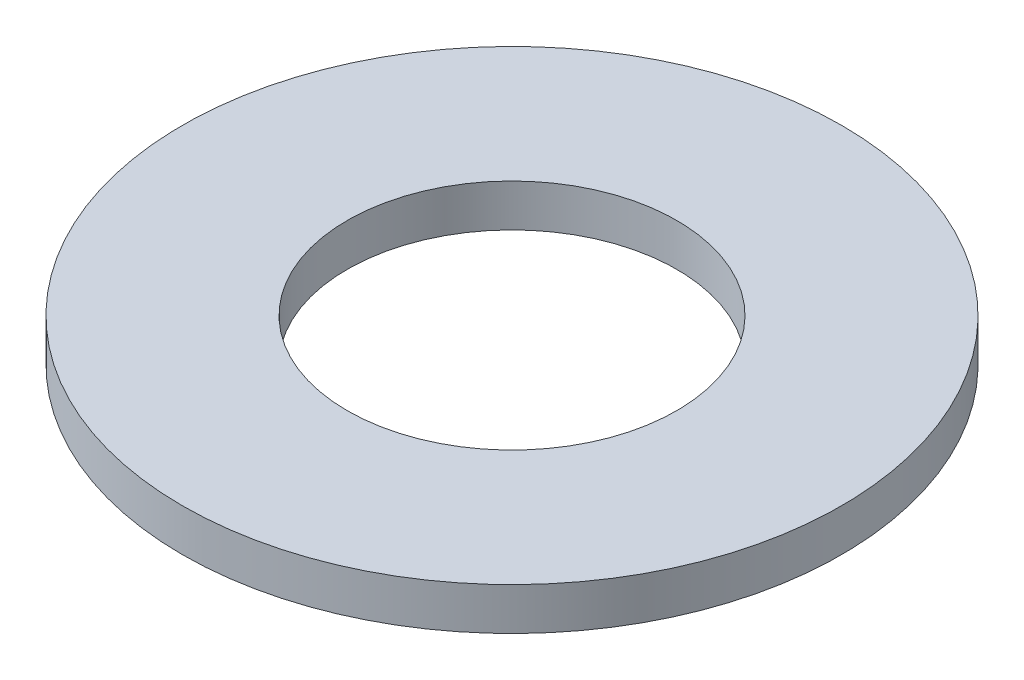
ISO-10303-21;
HEADER;
FILE_DESCRIPTION(('STEP AP214'),'2;1');
FILE_NAME('part.step','',(''),(''),'','','');
FILE_SCHEMA(('AUTOMOTIVE_DESIGN { 1 0 10303 214 1 1 1 1 }'));
ENDSEC;
DATA;
#1=APPLICATION_CONTEXT('core data for automotive mechanical design processes');
#2=APPLICATION_PROTOCOL_DEFINITION('international standard','automotive_design',2000,#1);
#3=PRODUCT_CONTEXT('',#1,'mechanical');
#4=PRODUCT('Part','Part','',(#3));
#5=PRODUCT_RELATED_PRODUCT_CATEGORY('part','',(#4));
#6=PRODUCT_DEFINITION_FORMATION('','',#4);
#7=PRODUCT_DEFINITION_CONTEXT('part definition',#1,'design');
#8=PRODUCT_DEFINITION('design','',#6,#7);
#9=PRODUCT_DEFINITION_SHAPE('','',#8);
#10=(LENGTH_UNIT() NAMED_UNIT(*) SI_UNIT(.MILLI.,.METRE.));
#11=(NAMED_UNIT(*) PLANE_ANGLE_UNIT() SI_UNIT($,.RADIAN.));
#12=(NAMED_UNIT(*) SI_UNIT($,.STERADIAN.) SOLID_ANGLE_UNIT());
#13=UNCERTAINTY_MEASURE_WITH_UNIT(LENGTH_MEASURE(1.E-05),#10,'distance_accuracy_value','');
#14=(GEOMETRIC_REPRESENTATION_CONTEXT(3) GLOBAL_UNCERTAINTY_ASSIGNED_CONTEXT((#13)) GLOBAL_UNIT_ASSIGNED_CONTEXT((#10,
#11,#12)) REPRESENTATION_CONTEXT('',''));
#15=CARTESIAN_POINT('',(0.,0.,0.));
#16=DIRECTION('',(0.,0.,1.));
#17=DIRECTION('',(1.,0.,0.));
#18=AXIS2_PLACEMENT_3D('',#15,#16,#17);
#19=CARTESIAN_POINT('',(0.,9.,0.));
#20=DIRECTION('',(0.,-1.,0.));
#21=DIRECTION('',(0.,0.,-1.));
#22=AXIS2_PLACEMENT_3D('',#19,#20,#21);
#23=CYLINDRICAL_SURFACE('',#22,70.);
#24=CARTESIAN_POINT('',(0.,9.,0.));
#25=DIRECTION('',(0.,1.,0.));
#26=DIRECTION('',(0.,0.,1.));
#27=AXIS2_PLACEMENT_3D('',#24,#25,#26);
#28=CIRCLE('',#27,70.);
#29=CARTESIAN_POINT('',(0.,9.,70.));
#30=VERTEX_POINT('',#29);
#31=EDGE_CURVE('E10',#30,#30,#28,.T.);
#32=ORIENTED_EDGE('',*,*,#31,.F.);
#33=EDGE_LOOP('',(#32));
#34=FACE_BOUND('',#33,.T.);
#35=CARTESIAN_POINT('',(0.,0.,0.));
#36=DIRECTION('',(0.,1.,0.));
#37=DIRECTION('',(0.,0.,1.));
#38=AXIS2_PLACEMENT_3D('',#35,#36,#37);
#39=CIRCLE('',#38,70.);
#40=CARTESIAN_POINT('',(0.,0.,70.));
#41=VERTEX_POINT('',#40);
#42=EDGE_CURVE('E37',#41,#41,#39,.T.);
#43=ORIENTED_EDGE('',*,*,#42,.T.);
#44=EDGE_LOOP('',(#43));
#45=FACE_BOUND('',#44,.T.);
#46=ADVANCED_FACE('F40',(#34,#45),#23,.T.);
#47=CARTESIAN_POINT('',(0.,9.,0.));
#48=DIRECTION('',(0.,1.,0.));
#49=DIRECTION('',(0.,0.,1.));
#50=AXIS2_PLACEMENT_3D('',#47,#48,#49);
#51=PLANE('',#50);
#52=CARTESIAN_POINT('',(0.,9.,0.));
#53=DIRECTION('',(0.,1.,0.));
#54=DIRECTION('',(0.,0.,1.));
#55=AXIS2_PLACEMENT_3D('',#52,#53,#54);
#56=CIRCLE('',#55,35.);
#57=CARTESIAN_POINT('',(0.,9.,35.));
#58=VERTEX_POINT('',#57);
#59=EDGE_CURVE('E50',#58,#58,#56,.T.);
#60=ORIENTED_EDGE('',*,*,#59,.F.);
#61=EDGE_LOOP('',(#60));
#62=FACE_BOUND('',#61,.T.);
#63=ORIENTED_EDGE('',*,*,#31,.T.);
#64=EDGE_LOOP('',(#63));
#65=FACE_BOUND('',#64,.T.);
#66=ADVANCED_FACE('F59',(#62,#65),#51,.T.);
#67=CARTESIAN_POINT('',(0.,0.,0.));
#68=DIRECTION('',(0.,1.,0.));
#69=DIRECTION('',(0.,0.,1.));
#70=AXIS2_PLACEMENT_3D('',#67,#68,#69);
#71=PLANE('',#70);
#72=CARTESIAN_POINT('',(0.,0.,0.));
#73=DIRECTION('',(0.,1.,0.));
#74=DIRECTION('',(0.,0.,1.));
#75=AXIS2_PLACEMENT_3D('',#72,#73,#74);
#76=CIRCLE('',#75,35.);
#77=CARTESIAN_POINT('',(0.,0.,35.));
#78=VERTEX_POINT('',#77);
#79=EDGE_CURVE('E47',#78,#78,#76,.T.);
#80=ORIENTED_EDGE('',*,*,#79,.T.);
#81=EDGE_LOOP('',(#80));
#82=FACE_BOUND('',#81,.T.);
#83=ORIENTED_EDGE('',*,*,#42,.F.);
#84=EDGE_LOOP('',(#83));
#85=FACE_BOUND('',#84,.T.);
#86=ADVANCED_FACE('F58',(#82,#85),#71,.F.);
#87=CARTESIAN_POINT('',(0.,9.,0.));
#88=DIRECTION('',(0.,-1.,0.));
#89=DIRECTION('',(0.,0.,-1.));
#90=AXIS2_PLACEMENT_3D('',#87,#88,#89);
#91=CYLINDRICAL_SURFACE('',#90,35.);
#92=ORIENTED_EDGE('',*,*,#59,.T.);
#93=EDGE_LOOP('',(#92));
#94=FACE_BOUND('',#93,.T.);
#95=ORIENTED_EDGE('',*,*,#79,.F.);
#96=EDGE_LOOP('',(#95));
#97=FACE_BOUND('',#96,.T.);
#98=ADVANCED_FACE('F54',(#94,#97),#91,.F.);
#99=CLOSED_SHELL('',(#46,#66,#86,#98));
#100=MANIFOLD_SOLID_BREP('B2',#99);
#101=ADVANCED_BREP_SHAPE_REPRESENTATION('',(#18,#100),#14);
#102=SHAPE_DEFINITION_REPRESENTATION(#9,#101);
ENDSEC;
END-ISO-10303-21;
